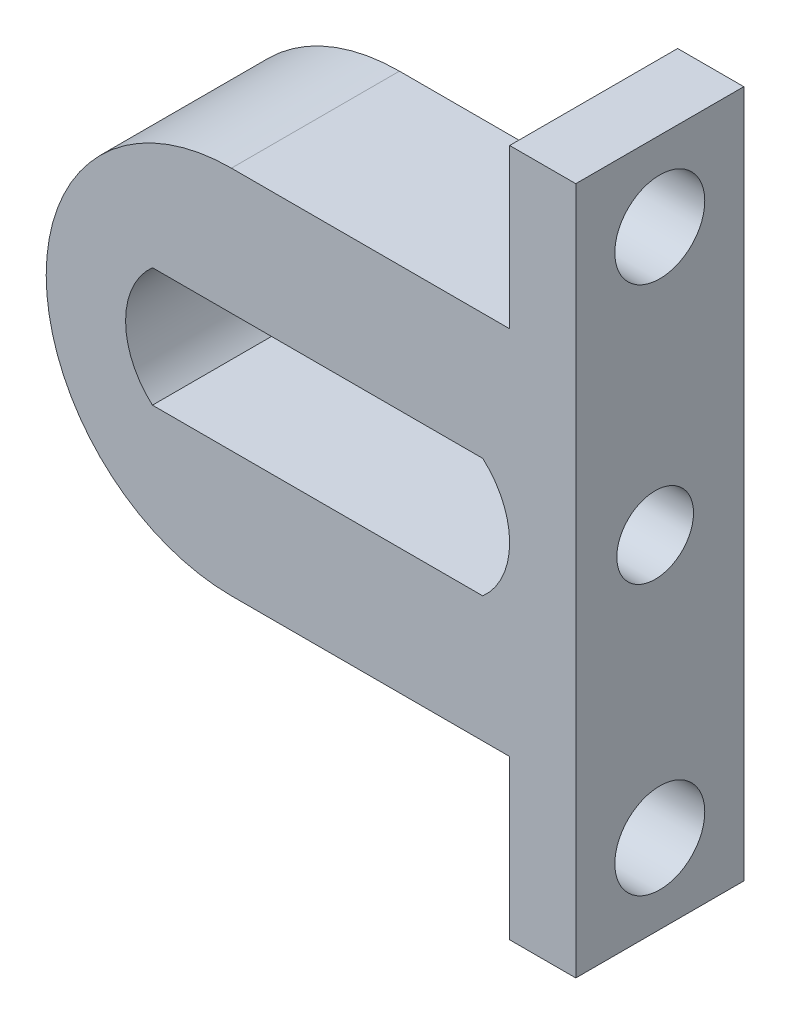
ISO-10303-21;
HEADER;
FILE_DESCRIPTION(('STEP AP214'),'2;1');
FILE_NAME('part.step','',(''),(''),'','','');
FILE_SCHEMA(('AUTOMOTIVE_DESIGN { 1 0 10303 214 1 1 1 1 }'));
ENDSEC;
DATA;
#1=APPLICATION_CONTEXT('core data for automotive mechanical design processes');
#2=APPLICATION_PROTOCOL_DEFINITION('international standard','automotive_design',2000,#1);
#3=PRODUCT_CONTEXT('',#1,'mechanical');
#4=PRODUCT('Part','Part','',(#3));
#5=PRODUCT_RELATED_PRODUCT_CATEGORY('part','',(#4));
#6=PRODUCT_DEFINITION_FORMATION('','',#4);
#7=PRODUCT_DEFINITION_CONTEXT('part definition',#1,'design');
#8=PRODUCT_DEFINITION('design','',#6,#7);
#9=PRODUCT_DEFINITION_SHAPE('','',#8);
#10=(LENGTH_UNIT() NAMED_UNIT(*) SI_UNIT(.MILLI.,.METRE.));
#11=(NAMED_UNIT(*) PLANE_ANGLE_UNIT() SI_UNIT($,.RADIAN.));
#12=(NAMED_UNIT(*) SI_UNIT($,.STERADIAN.) SOLID_ANGLE_UNIT());
#13=UNCERTAINTY_MEASURE_WITH_UNIT(LENGTH_MEASURE(1.E-05),#10,'distance_accuracy_value','');
#14=(GEOMETRIC_REPRESENTATION_CONTEXT(3) GLOBAL_UNCERTAINTY_ASSIGNED_CONTEXT((#13)) GLOBAL_UNIT_ASSIGNED_CONTEXT((#10,
#11,#12)) REPRESENTATION_CONTEXT('',''));
#15=CARTESIAN_POINT('',(0.,0.,0.));
#16=DIRECTION('',(0.,0.,1.));
#17=DIRECTION('',(1.,0.,0.));
#18=AXIS2_PLACEMENT_3D('',#15,#16,#17);
#19=CARTESIAN_POINT('',(502.194313483298,55.7906330730378,6.35));
#20=DIRECTION('',(0.,0.,1.));
#21=DIRECTION('',(1.,0.,0.));
#22=AXIS2_PLACEMENT_3D('',#19,#20,#21);
#23=PLANE('',#22);
#24=DIRECTION('',(0.,1.,0.));
#25=VECTOR('',#24,1.);
#26=CARTESIAN_POINT('',(515.21,42.7906330730378,6.35));
#27=LINE('',#26,#25);
#28=CARTESIAN_POINT('',(515.21,42.7906330730378,6.35));
#29=VERTEX_POINT('',#28);
#30=CARTESIAN_POINT('',(515.21,68.7906330730378,6.35));
#31=VERTEX_POINT('',#30);
#32=EDGE_CURVE('E158',#29,#31,#27,.T.);
#33=ORIENTED_EDGE('',*,*,#32,.T.);
#34=DIRECTION('',(-1.,0.,0.));
#35=VECTOR('',#34,1.);
#36=CARTESIAN_POINT('',(515.21,68.7906330730378,6.35));
#37=LINE('',#36,#35);
#38=CARTESIAN_POINT('',(512.71,68.7906330730378,6.35));
#39=VERTEX_POINT('',#38);
#40=EDGE_CURVE('E161',#31,#39,#37,.T.);
#41=ORIENTED_EDGE('',*,*,#40,.T.);
#42=DIRECTION('',(0.,-1.,0.));
#43=VECTOR('',#42,1.);
#44=CARTESIAN_POINT('',(512.71,62.7906330730378,6.35));
#45=LINE('',#44,#43);
#46=CARTESIAN_POINT('',(512.71,62.7906330730378,6.35));
#47=VERTEX_POINT('',#46);
#48=EDGE_CURVE('E164',#39,#47,#45,.T.);
#49=ORIENTED_EDGE('',*,*,#48,.T.);
#50=DIRECTION('',(-1.,0.,0.));
#51=VECTOR('',#50,1.);
#52=CARTESIAN_POINT('',(502.194313483298,62.7906330730377,6.35));
#53=LINE('',#52,#51);
#54=CARTESIAN_POINT('',(502.194313483298,62.7906330730377,6.35));
#55=VERTEX_POINT('',#54);
#56=EDGE_CURVE('E166',#47,#55,#53,.T.);
#57=ORIENTED_EDGE('',*,*,#56,.T.);
#58=CARTESIAN_POINT('',(502.194313483298,55.7906330730378,6.35));
#59=DIRECTION('',(0.,0.,1.));
#60=DIRECTION('',(1.,0.,0.));
#61=AXIS2_PLACEMENT_3D('',#58,#59,#60);
#62=CIRCLE('',#61,6.99999999999998);
#63=CARTESIAN_POINT('',(502.194313483298,48.7906330730378,6.35));
#64=VERTEX_POINT('',#63);
#65=EDGE_CURVE('E168',#55,#64,#62,.T.);
#66=ORIENTED_EDGE('',*,*,#65,.T.);
#67=DIRECTION('',(1.,0.,0.));
#68=VECTOR('',#67,1.);
#69=CARTESIAN_POINT('',(512.71,48.7906330730378,6.35));
#70=LINE('',#69,#68);
#71=CARTESIAN_POINT('',(512.71,48.7906330730378,6.35));
#72=VERTEX_POINT('',#71);
#73=EDGE_CURVE('E170',#64,#72,#70,.T.);
#74=ORIENTED_EDGE('',*,*,#73,.T.);
#75=DIRECTION('',(0.,-1.,0.));
#76=VECTOR('',#75,1.);
#77=CARTESIAN_POINT('',(512.71,42.7906330730378,6.35));
#78=LINE('',#77,#76);
#79=CARTESIAN_POINT('',(512.71,42.7906330730378,6.35));
#80=VERTEX_POINT('',#79);
#81=EDGE_CURVE('E172',#72,#80,#78,.T.);
#82=ORIENTED_EDGE('',*,*,#81,.T.);
#83=DIRECTION('',(1.,0.,0.));
#84=VECTOR('',#83,1.);
#85=CARTESIAN_POINT('',(515.21,42.7906330730378,6.35));
#86=LINE('',#85,#84);
#87=EDGE_CURVE('E174',#80,#29,#86,.T.);
#88=ORIENTED_EDGE('',*,*,#87,.T.);
#89=EDGE_LOOP('',(#33,#41,#49,#57,#66,#74,#82,#88));
#90=FACE_BOUND('',#89,.T.);
#91=DIRECTION('',(-1.,0.,0.));
#92=VECTOR('',#91,1.);
#93=CARTESIAN_POINT('',(511.694313483298,58.0406330730378,6.35));
#94=LINE('',#93,#92);
#95=CARTESIAN_POINT('',(511.694313483298,58.0406330730378,6.35));
#96=VERTEX_POINT('',#95);
#97=CARTESIAN_POINT('',(499.21,58.0406330730378,6.35));
#98=VERTEX_POINT('',#97);
#99=EDGE_CURVE('E128',#96,#98,#94,.T.);
#100=ORIENTED_EDGE('',*,*,#99,.F.);
#101=CARTESIAN_POINT('',(509.71,55.7906330730378,6.35));
#102=DIRECTION('',(0.,0.,1.));
#103=DIRECTION('',(1.,0.,0.));
#104=AXIS2_PLACEMENT_3D('',#101,#102,#103);
#105=CIRCLE('',#104,2.99999999999998);
#106=CARTESIAN_POINT('',(511.694313483298,53.5406330730378,6.35));
#107=VERTEX_POINT('',#106);
#108=EDGE_CURVE('E120',#107,#96,#105,.T.);
#109=ORIENTED_EDGE('',*,*,#108,.F.);
#110=DIRECTION('',(1.,0.,0.));
#111=VECTOR('',#110,1.);
#112=CARTESIAN_POINT('',(511.694313483298,53.5406330730378,6.35));
#113=LINE('',#112,#111);
#114=CARTESIAN_POINT('',(499.21,53.5406330730378,6.35));
#115=VERTEX_POINT('',#114);
#116=EDGE_CURVE('E142',#115,#107,#113,.T.);
#117=ORIENTED_EDGE('',*,*,#116,.F.);
#118=CARTESIAN_POINT('',(501.194313483298,55.7906330730378,6.35));
#119=DIRECTION('',(0.,0.,1.));
#120=DIRECTION('',(1.,0.,0.));
#121=AXIS2_PLACEMENT_3D('',#118,#119,#120);
#122=CIRCLE('',#121,2.99999999999998);
#123=EDGE_CURVE('E140',#98,#115,#122,.T.);
#124=ORIENTED_EDGE('',*,*,#123,.F.);
#125=EDGE_LOOP('',(#100,#109,#117,#124));
#126=FACE_BOUND('',#125,.T.);
#127=ADVANCED_FACE('F31',(#90,#126),#23,.T.);
#128=CARTESIAN_POINT('',(502.194313483298,55.7906330730378,0.));
#129=DIRECTION('',(0.,0.,1.));
#130=DIRECTION('',(1.,0.,0.));
#131=AXIS2_PLACEMENT_3D('',#128,#129,#130);
#132=PLANE('',#131);
#133=DIRECTION('',(0.,1.,0.));
#134=VECTOR('',#133,1.);
#135=CARTESIAN_POINT('',(515.21,42.7906330730378,0.));
#136=LINE('',#135,#134);
#137=CARTESIAN_POINT('',(515.21,42.7906330730378,0.));
#138=VERTEX_POINT('',#137);
#139=CARTESIAN_POINT('',(515.21,68.7906330730378,0.));
#140=VERTEX_POINT('',#139);
#141=EDGE_CURVE('E136',#138,#140,#136,.T.);
#142=ORIENTED_EDGE('',*,*,#141,.F.);
#143=DIRECTION('',(1.,0.,0.));
#144=VECTOR('',#143,1.);
#145=CARTESIAN_POINT('',(515.21,42.7906330730378,0.));
#146=LINE('',#145,#144);
#147=CARTESIAN_POINT('',(512.71,42.7906330730378,0.));
#148=VERTEX_POINT('',#147);
#149=EDGE_CURVE('E162',#148,#138,#146,.T.);
#150=ORIENTED_EDGE('',*,*,#149,.F.);
#151=DIRECTION('',(0.,-1.,0.));
#152=VECTOR('',#151,1.);
#153=CARTESIAN_POINT('',(512.71,42.7906330730378,0.));
#154=LINE('',#153,#152);
#155=CARTESIAN_POINT('',(512.71,48.7906330730378,0.));
#156=VERTEX_POINT('',#155);
#157=EDGE_CURVE('E189',#156,#148,#154,.T.);
#158=ORIENTED_EDGE('',*,*,#157,.F.);
#159=DIRECTION('',(1.,0.,0.));
#160=VECTOR('',#159,1.);
#161=CARTESIAN_POINT('',(512.71,48.7906330730378,0.));
#162=LINE('',#161,#160);
#163=CARTESIAN_POINT('',(502.194313483298,48.7906330730378,0.));
#164=VERTEX_POINT('',#163);
#165=EDGE_CURVE('E187',#164,#156,#162,.T.);
#166=ORIENTED_EDGE('',*,*,#165,.F.);
#167=CARTESIAN_POINT('',(502.194313483298,55.7906330730378,0.));
#168=DIRECTION('',(0.,0.,1.));
#169=DIRECTION('',(1.,0.,0.));
#170=AXIS2_PLACEMENT_3D('',#167,#168,#169);
#171=CIRCLE('',#170,6.99999999999998);
#172=CARTESIAN_POINT('',(502.194313483298,62.7906330730377,0.));
#173=VERTEX_POINT('',#172);
#174=EDGE_CURVE('E185',#173,#164,#171,.T.);
#175=ORIENTED_EDGE('',*,*,#174,.F.);
#176=DIRECTION('',(-1.,0.,0.));
#177=VECTOR('',#176,1.);
#178=CARTESIAN_POINT('',(502.194313483298,62.7906330730377,0.));
#179=LINE('',#178,#177);
#180=CARTESIAN_POINT('',(512.71,62.7906330730378,0.));
#181=VERTEX_POINT('',#180);
#182=EDGE_CURVE('E183',#181,#173,#179,.T.);
#183=ORIENTED_EDGE('',*,*,#182,.F.);
#184=DIRECTION('',(0.,-1.,0.));
#185=VECTOR('',#184,1.);
#186=CARTESIAN_POINT('',(512.71,62.7906330730378,0.));
#187=LINE('',#186,#185);
#188=CARTESIAN_POINT('',(512.71,68.7906330730378,0.));
#189=VERTEX_POINT('',#188);
#190=EDGE_CURVE('E181',#189,#181,#187,.T.);
#191=ORIENTED_EDGE('',*,*,#190,.F.);
#192=DIRECTION('',(-1.,0.,0.));
#193=VECTOR('',#192,1.);
#194=CARTESIAN_POINT('',(515.21,68.7906330730378,0.));
#195=LINE('',#194,#193);
#196=EDGE_CURVE('E179',#140,#189,#195,.T.);
#197=ORIENTED_EDGE('',*,*,#196,.F.);
#198=EDGE_LOOP('',(#142,#150,#158,#166,#175,#183,#191,#197));
#199=FACE_BOUND('',#198,.T.);
#200=CARTESIAN_POINT('',(509.71,55.7906330730378,0.));
#201=DIRECTION('',(0.,0.,1.));
#202=DIRECTION('',(1.,0.,0.));
#203=AXIS2_PLACEMENT_3D('',#200,#201,#202);
#204=CIRCLE('',#203,2.99999999999998);
#205=CARTESIAN_POINT('',(511.694313483298,53.5406330730378,0.));
#206=VERTEX_POINT('',#205);
#207=CARTESIAN_POINT('',(511.694313483298,58.0406330730378,0.));
#208=VERTEX_POINT('',#207);
#209=EDGE_CURVE('E54',#206,#208,#204,.T.);
#210=ORIENTED_EDGE('',*,*,#209,.T.);
#211=DIRECTION('',(-1.,0.,0.));
#212=VECTOR('',#211,1.);
#213=CARTESIAN_POINT('',(511.694313483298,58.0406330730378,0.));
#214=LINE('',#213,#212);
#215=CARTESIAN_POINT('',(499.21,58.0406330730378,0.));
#216=VERTEX_POINT('',#215);
#217=EDGE_CURVE('E135',#208,#216,#214,.T.);
#218=ORIENTED_EDGE('',*,*,#217,.T.);
#219=CARTESIAN_POINT('',(501.194313483298,55.7906330730378,0.));
#220=DIRECTION('',(0.,0.,1.));
#221=DIRECTION('',(1.,0.,0.));
#222=AXIS2_PLACEMENT_3D('',#219,#220,#221);
#223=CIRCLE('',#222,2.99999999999998);
#224=CARTESIAN_POINT('',(499.21,53.5406330730378,0.));
#225=VERTEX_POINT('',#224);
#226=EDGE_CURVE('E150',#216,#225,#223,.T.);
#227=ORIENTED_EDGE('',*,*,#226,.T.);
#228=DIRECTION('',(1.,0.,0.));
#229=VECTOR('',#228,1.);
#230=CARTESIAN_POINT('',(511.694313483298,53.5406330730378,0.));
#231=LINE('',#230,#229);
#232=EDGE_CURVE('E129',#225,#206,#231,.T.);
#233=ORIENTED_EDGE('',*,*,#232,.T.);
#234=EDGE_LOOP('',(#210,#218,#227,#233));
#235=FACE_BOUND('',#234,.T.);
#236=ADVANCED_FACE('F219',(#199,#235),#132,.F.);
#237=CARTESIAN_POINT('',(515.21,42.7906330730378,6.35));
#238=DIRECTION('',(-1.,0.,0.));
#239=DIRECTION('',(0.,0.,1.));
#240=AXIS2_PLACEMENT_3D('',#237,#238,#239);
#241=PLANE('',#240);
#242=CARTESIAN_POINT('',(515.21,65.7906330730378,3.175));
#243=DIRECTION('',(1.,0.,0.));
#244=DIRECTION('',(0.,0.,-1.));
#245=AXIS2_PLACEMENT_3D('',#242,#243,#244);
#246=CIRCLE('',#245,1.7);
#247=CARTESIAN_POINT('',(515.21,65.7906330730378,1.475));
#248=VERTEX_POINT('',#247);
#249=EDGE_CURVE('E288',#248,#248,#246,.T.);
#250=ORIENTED_EDGE('',*,*,#249,.F.);
#251=EDGE_LOOP('',(#250));
#252=FACE_BOUND('',#251,.T.);
#253=CARTESIAN_POINT('',(515.21,55.7906330730378,3.35));
#254=DIRECTION('',(1.,0.,0.));
#255=DIRECTION('',(0.,0.,-1.));
#256=AXIS2_PLACEMENT_3D('',#253,#254,#255);
#257=CIRCLE('',#256,1.45);
#258=CARTESIAN_POINT('',(515.21,55.7906330730378,1.9));
#259=VERTEX_POINT('',#258);
#260=EDGE_CURVE('E281',#259,#259,#257,.T.);
#261=ORIENTED_EDGE('',*,*,#260,.F.);
#262=EDGE_LOOP('',(#261));
#263=FACE_BOUND('',#262,.T.);
#264=CARTESIAN_POINT('',(515.21,45.7906330730378,3.175));
#265=DIRECTION('',(1.,0.,0.));
#266=DIRECTION('',(0.,0.,-1.));
#267=AXIS2_PLACEMENT_3D('',#264,#265,#266);
#268=CIRCLE('',#267,1.7);
#269=CARTESIAN_POINT('',(515.21,45.7906330730378,1.475));
#270=VERTEX_POINT('',#269);
#271=EDGE_CURVE('E285',#270,#270,#268,.T.);
#272=ORIENTED_EDGE('',*,*,#271,.F.);
#273=EDGE_LOOP('',(#272));
#274=FACE_BOUND('',#273,.T.);
#275=ORIENTED_EDGE('',*,*,#141,.T.);
#276=DIRECTION('',(0.,0.,-1.));
#277=VECTOR('',#276,1.);
#278=CARTESIAN_POINT('',(515.21,68.7906330730378,6.35));
#279=LINE('',#278,#277);
#280=EDGE_CURVE('E11',#31,#140,#279,.T.);
#281=ORIENTED_EDGE('',*,*,#280,.F.);
#282=ORIENTED_EDGE('',*,*,#32,.F.);
#283=DIRECTION('',(0.,0.,-1.));
#284=VECTOR('',#283,1.);
#285=CARTESIAN_POINT('',(515.21,42.7906330730378,6.35));
#286=LINE('',#285,#284);
#287=EDGE_CURVE('E176',#29,#138,#286,.T.);
#288=ORIENTED_EDGE('',*,*,#287,.T.);
#289=EDGE_LOOP('',(#275,#281,#282,#288));
#290=FACE_BOUND('',#289,.T.);
#291=ADVANCED_FACE('F33',(#252,#263,#274,#290),#241,.F.);
#292=CARTESIAN_POINT('',(515.21,68.7906330730378,6.35));
#293=DIRECTION('',(0.,-1.,0.));
#294=DIRECTION('',(0.,0.,-1.));
#295=AXIS2_PLACEMENT_3D('',#292,#293,#294);
#296=PLANE('',#295);
#297=ORIENTED_EDGE('',*,*,#196,.T.);
#298=DIRECTION('',(0.,0.,-1.));
#299=VECTOR('',#298,1.);
#300=CARTESIAN_POINT('',(512.71,68.7906330730378,6.35));
#301=LINE('',#300,#299);
#302=EDGE_CURVE('E39',#39,#189,#301,.T.);
#303=ORIENTED_EDGE('',*,*,#302,.F.);
#304=ORIENTED_EDGE('',*,*,#40,.F.);
#305=ORIENTED_EDGE('',*,*,#280,.T.);
#306=EDGE_LOOP('',(#297,#303,#304,#305));
#307=FACE_BOUND('',#306,.T.);
#308=ADVANCED_FACE('F236',(#307),#296,.F.);
#309=CARTESIAN_POINT('',(512.71,62.7906330730378,6.35));
#310=DIRECTION('',(1.,0.,0.));
#311=DIRECTION('',(0.,0.,-1.));
#312=AXIS2_PLACEMENT_3D('',#309,#310,#311);
#313=PLANE('',#312);
#314=CARTESIAN_POINT('',(512.71,65.7906330730378,3.175));
#315=DIRECTION('',(1.,0.,0.));
#316=DIRECTION('',(0.,0.,-1.));
#317=AXIS2_PLACEMENT_3D('',#314,#315,#316);
#318=CIRCLE('',#317,1.7);
#319=CARTESIAN_POINT('',(512.71,65.7906330730378,1.475));
#320=VERTEX_POINT('',#319);
#321=EDGE_CURVE('E282',#320,#320,#318,.F.);
#322=ORIENTED_EDGE('',*,*,#321,.F.);
#323=EDGE_LOOP('',(#322));
#324=FACE_BOUND('',#323,.T.);
#325=ORIENTED_EDGE('',*,*,#190,.T.);
#326=DIRECTION('',(0.,0.,-1.));
#327=VECTOR('',#326,1.);
#328=CARTESIAN_POINT('',(512.71,62.7906330730378,6.35));
#329=LINE('',#328,#327);
#330=EDGE_CURVE('E206',#47,#181,#329,.T.);
#331=ORIENTED_EDGE('',*,*,#330,.F.);
#332=ORIENTED_EDGE('',*,*,#48,.F.);
#333=ORIENTED_EDGE('',*,*,#302,.T.);
#334=EDGE_LOOP('',(#325,#331,#332,#333));
#335=FACE_BOUND('',#334,.T.);
#336=ADVANCED_FACE('F213',(#324,#335),#313,.F.);
#337=CARTESIAN_POINT('',(502.194313483298,62.7906330730377,6.35));
#338=DIRECTION('',(0.,-1.,0.));
#339=DIRECTION('',(1.,0.,0.));
#340=AXIS2_PLACEMENT_3D('',#337,#338,#339);
#341=PLANE('',#340);
#342=ORIENTED_EDGE('',*,*,#182,.T.);
#343=DIRECTION('',(0.,0.,-1.));
#344=VECTOR('',#343,1.);
#345=CARTESIAN_POINT('',(502.194313483298,62.7906330730377,6.35));
#346=LINE('',#345,#344);
#347=EDGE_CURVE('E203',#55,#173,#346,.T.);
#348=ORIENTED_EDGE('',*,*,#347,.F.);
#349=ORIENTED_EDGE('',*,*,#56,.F.);
#350=ORIENTED_EDGE('',*,*,#330,.T.);
#351=EDGE_LOOP('',(#342,#348,#349,#350));
#352=FACE_BOUND('',#351,.T.);
#353=ADVANCED_FACE('F225',(#352),#341,.F.);
#354=CARTESIAN_POINT('',(502.194313483298,55.7906330730378,6.35));
#355=DIRECTION('',(0.,0.,-1.));
#356=DIRECTION('',(-1.,0.,0.));
#357=AXIS2_PLACEMENT_3D('',#354,#355,#356);
#358=CYLINDRICAL_SURFACE('',#357,6.99999999999998);
#359=ORIENTED_EDGE('',*,*,#174,.T.);
#360=DIRECTION('',(0.,0.,-1.));
#361=VECTOR('',#360,1.);
#362=CARTESIAN_POINT('',(502.194313483298,48.7906330730378,6.35));
#363=LINE('',#362,#361);
#364=EDGE_CURVE('E200',#64,#164,#363,.T.);
#365=ORIENTED_EDGE('',*,*,#364,.F.);
#366=ORIENTED_EDGE('',*,*,#65,.F.);
#367=ORIENTED_EDGE('',*,*,#347,.T.);
#368=EDGE_LOOP('',(#359,#365,#366,#367));
#369=FACE_BOUND('',#368,.T.);
#370=ADVANCED_FACE('F229',(#369),#358,.T.);
#371=CARTESIAN_POINT('',(512.71,48.7906330730378,6.35));
#372=DIRECTION('',(0.,1.,0.));
#373=DIRECTION('',(-1.,0.,0.));
#374=AXIS2_PLACEMENT_3D('',#371,#372,#373);
#375=PLANE('',#374);
#376=ORIENTED_EDGE('',*,*,#165,.T.);
#377=DIRECTION('',(0.,0.,-1.));
#378=VECTOR('',#377,1.);
#379=CARTESIAN_POINT('',(512.71,48.7906330730378,6.35));
#380=LINE('',#379,#378);
#381=EDGE_CURVE('E197',#72,#156,#380,.T.);
#382=ORIENTED_EDGE('',*,*,#381,.F.);
#383=ORIENTED_EDGE('',*,*,#73,.F.);
#384=ORIENTED_EDGE('',*,*,#364,.T.);
#385=EDGE_LOOP('',(#376,#382,#383,#384));
#386=FACE_BOUND('',#385,.T.);
#387=ADVANCED_FACE('F249',(#386),#375,.F.);
#388=CARTESIAN_POINT('',(512.71,42.7906330730378,6.35));
#389=DIRECTION('',(1.,0.,0.));
#390=DIRECTION('',(0.,0.,-1.));
#391=AXIS2_PLACEMENT_3D('',#388,#389,#390);
#392=PLANE('',#391);
#393=CARTESIAN_POINT('',(512.71,45.7906330730378,3.175));
#394=DIRECTION('',(1.,0.,0.));
#395=DIRECTION('',(0.,0.,-1.));
#396=AXIS2_PLACEMENT_3D('',#393,#394,#395);
#397=CIRCLE('',#396,1.7);
#398=CARTESIAN_POINT('',(512.71,45.7906330730378,1.475));
#399=VERTEX_POINT('',#398);
#400=EDGE_CURVE('E148',#399,#399,#397,.F.);
#401=ORIENTED_EDGE('',*,*,#400,.F.);
#402=EDGE_LOOP('',(#401));
#403=FACE_BOUND('',#402,.T.);
#404=ORIENTED_EDGE('',*,*,#157,.T.);
#405=DIRECTION('',(0.,0.,-1.));
#406=VECTOR('',#405,1.);
#407=CARTESIAN_POINT('',(512.71,42.7906330730378,6.35));
#408=LINE('',#407,#406);
#409=EDGE_CURVE('E194',#80,#148,#408,.T.);
#410=ORIENTED_EDGE('',*,*,#409,.F.);
#411=ORIENTED_EDGE('',*,*,#81,.F.);
#412=ORIENTED_EDGE('',*,*,#381,.T.);
#413=EDGE_LOOP('',(#404,#410,#411,#412));
#414=FACE_BOUND('',#413,.T.);
#415=ADVANCED_FACE('F247',(#403,#414),#392,.F.);
#416=CARTESIAN_POINT('',(515.21,42.7906330730378,6.35));
#417=DIRECTION('',(0.,1.,0.));
#418=DIRECTION('',(0.,0.,1.));
#419=AXIS2_PLACEMENT_3D('',#416,#417,#418);
#420=PLANE('',#419);
#421=ORIENTED_EDGE('',*,*,#149,.T.);
#422=ORIENTED_EDGE('',*,*,#287,.F.);
#423=ORIENTED_EDGE('',*,*,#87,.F.);
#424=ORIENTED_EDGE('',*,*,#409,.T.);
#425=EDGE_LOOP('',(#421,#422,#423,#424));
#426=FACE_BOUND('',#425,.T.);
#427=ADVANCED_FACE('F242',(#426),#420,.F.);
#428=CARTESIAN_POINT('',(509.71,55.7906330730378,6.35));
#429=DIRECTION('',(0.,0.,-1.));
#430=DIRECTION('',(-1.,0.,0.));
#431=AXIS2_PLACEMENT_3D('',#428,#429,#430);
#432=CYLINDRICAL_SURFACE('',#431,2.99999999999998);
#433=CARTESIAN_POINT('',(512.71,55.7906330730378,1.9));
#434=CARTESIAN_POINT('',(512.709996120813,55.8671638005357,1.90000454051934));
#435=CARTESIAN_POINT('',(512.70703967394,55.9437947157731,1.90609458799086));
#436=CARTESIAN_POINT('',(512.695505011524,56.0948106776822,1.93019437682024));
#437=CARTESIAN_POINT('',(512.686915203961,56.1691907618394,1.94822869720593));
#438=CARTESIAN_POINT('',(512.665016903127,56.3132865396194,1.99535722985119));
#439=CARTESIAN_POINT('',(512.65172634015,56.3830187769333,2.02440944608167));
#440=CARTESIAN_POINT('',(512.621661023413,56.5165251739773,2.09254126521249));
#441=CARTESIAN_POINT('',(512.604886697689,56.5803000642682,2.13161963637864));
#442=CARTESIAN_POINT('',(512.568281852369,56.7042173181824,2.22126434495922));
#443=CARTESIAN_POINT('',(512.548330923377,56.7639386061572,2.27236289708863));
#444=CARTESIAN_POINT('',(512.508039454466,56.8743469791893,2.38345730788836));
#445=CARTESIAN_POINT('',(512.48769864962,56.9250276612452,2.44345941783253));
#446=CARTESIAN_POINT('',(512.447270737028,57.0195254744831,2.5757950833783));
#447=CARTESIAN_POINT('',(512.427304864761,57.0625967489676,2.64870252781686));
#448=CARTESIAN_POINT('',(512.391883383016,57.1356841562065,2.80180406813567));
#449=CARTESIAN_POINT('',(512.376424719151,57.1657091368037,2.88199318091417));
#450=CARTESIAN_POINT('',(512.353115220385,57.2099776738166,3.04261116524232));
#451=CARTESIAN_POINT('',(512.344875171374,57.2250354704915,3.12275643535873));
#452=CARTESIAN_POINT('',(512.335876537716,57.2414501537766,3.2848250536738));
#453=CARTESIAN_POINT('',(512.335111392162,57.2428190554925,3.36674677931406));
#454=CARTESIAN_POINT('',(512.340832064055,57.2324170367151,3.52037720233886));
#455=CARTESIAN_POINT('',(512.346530152182,57.2220738120741,3.59221876115115));
#456=CARTESIAN_POINT('',(512.363165204595,57.1909979495867,3.73298277173976));
#457=CARTESIAN_POINT('',(512.374103664513,57.1702623456197,3.80190438403107));
#458=CARTESIAN_POINT('',(512.400235710196,57.1185949824647,3.93682221606916));
#459=CARTESIAN_POINT('',(512.41552247128,57.0874369857492,4.00271290766918));
#460=CARTESIAN_POINT('',(512.448626866195,57.0159786383798,4.12863681021759));
#461=CARTESIAN_POINT('',(512.466445625097,56.9756742188129,4.18866739716707));
#462=CARTESIAN_POINT('',(512.505139328159,56.8815390448591,4.30859047880133));
#463=CARTESIAN_POINT('',(512.526127412756,56.8266755745306,4.36763856656668));
#464=CARTESIAN_POINT('',(512.56708426032,56.7077084161121,4.47603367679154));
#465=CARTESIAN_POINT('',(512.587052593144,56.6436008716497,4.52537663012665));
#466=CARTESIAN_POINT('',(512.624718855516,56.5046340370301,4.61483223781985));
#467=CARTESIAN_POINT('',(512.642291076559,56.4294430240008,4.65448671536064));
#468=CARTESIAN_POINT('',(512.67214084082,56.2723910141114,4.72027077256354));
#469=CARTESIAN_POINT('',(512.684422323993,56.1905350347815,4.74641041948709));
#470=CARTESIAN_POINT('',(512.701490745182,56.0294212675513,4.78239158215606));
#471=CARTESIAN_POINT('',(512.70679351596,55.9504698537253,4.79335841629938));
#472=CARTESIAN_POINT('',(512.711049123702,55.7916803451623,4.80217544252438));
#473=CARTESIAN_POINT('',(512.71000468355,55.7118426453024,4.80003125908766));
#474=CARTESIAN_POINT('',(512.701992813503,55.5595913738422,4.78337558743059));
#475=CARTESIAN_POINT('',(512.695453252822,55.4870544955086,4.7697573111068));
#476=CARTESIAN_POINT('',(512.677640242866,55.3454274142302,4.73190686718402));
#477=CARTESIAN_POINT('',(512.666366255771,55.276337603862,4.70767349372184));
#478=CARTESIAN_POINT('',(512.639696471727,55.1411975181961,4.64858985122823));
#479=CARTESIAN_POINT('',(512.624187821198,55.0752992490074,4.61344462479574));
#480=CARTESIAN_POINT('',(512.590577420374,54.9501083556124,4.53386087389152));
#481=CARTESIAN_POINT('',(512.572474541511,54.8908186263857,4.48941830089837));
#482=CARTESIAN_POINT('',(512.533462677922,54.7746846144432,4.38771273329989));
#483=CARTESIAN_POINT('',(512.512449350254,54.7185818271074,4.32964139393037));
#484=CARTESIAN_POINT('',(512.471285276756,54.6166084032236,4.20479121190171));
#485=CARTESIAN_POINT('',(512.451135037319,54.5707437088897,4.13800734791283));
#486=CARTESIAN_POINT('',(512.413238440915,54.4888561302808,3.99419696186196));
#487=CARTESIAN_POINT('',(512.395620661561,54.4533009139544,3.91686736586735));
#488=CARTESIAN_POINT('',(512.366367720056,54.3960867412208,3.75618965009693));
#489=CARTESIAN_POINT('',(512.35472537944,54.3744111030878,3.672848889697));
#490=CARTESIAN_POINT('',(512.340113247011,54.3474705885969,3.51087109965609));
#491=CARTESIAN_POINT('',(512.336434575035,54.3408612239162,3.43252248368154));
#492=CARTESIAN_POINT('',(512.336190396806,54.3404168354502,3.275790225));
#493=CARTESIAN_POINT('',(512.339622415745,54.3465773672224,3.19740660396904));
#494=CARTESIAN_POINT('',(512.352480355355,54.3702628410193,3.04970843588792));
#495=CARTESIAN_POINT('',(512.361381278269,54.3867948111026,2.9801834859031));
#496=CARTESIAN_POINT('',(512.383597194996,54.4295835872121,2.84494752723667));
#497=CARTESIAN_POINT('',(512.396913546391,54.4558433844792,2.77923769887561));
#498=CARTESIAN_POINT('',(512.427555921327,54.5193309833468,2.64863489093796));
#499=CARTESIAN_POINT('',(512.445091047269,54.5571765360594,2.58409261384695));
#500=CARTESIAN_POINT('',(512.481800937264,54.6420441298391,2.46186405678044));
#501=CARTESIAN_POINT('',(512.500976513897,54.6890707336121,2.40418120876461));
#502=CARTESIAN_POINT('',(512.541348507621,54.7970828039165,2.29068285436661));
#503=CARTESIAN_POINT('',(512.562533725527,54.8590371007478,2.23578040555072));
#504=CARTESIAN_POINT('',(512.602555235273,54.9919247840983,2.13697934885735));
#505=CARTESIAN_POINT('',(512.621390345915,55.0628626500815,2.09308626333246));
#506=CARTESIAN_POINT('',(512.654678651136,55.2120896356891,2.01779340357102));
#507=CARTESIAN_POINT('',(512.669130475603,55.2903810438632,1.98639753471407));
#508=CARTESIAN_POINT('',(512.691925395612,55.451924198062,1.93760808408236));
#509=CARTESIAN_POINT('',(512.700286278153,55.5351607269358,1.92017371648439));
#510=CARTESIAN_POINT('',(512.706731744922,55.6477395442924,1.90677263876362));
#511=CARTESIAN_POINT('',(512.707954546114,55.6762406056135,1.9042360394183));
#512=CARTESIAN_POINT('',(512.709589409727,55.7333674566045,1.90084884917815));
#513=CARTESIAN_POINT('',(512.710001451694,55.7619932494027,1.8999983008175));
#514=CARTESIAN_POINT('',(512.71,55.7906330730378,1.9));
#515=B_SPLINE_CURVE_WITH_KNOTS('',3,(#433,#434,#435,#436,#437,#438,#439,#440,#441,#442,#443,
#444,#445,#446,#447,#448,#449,#450,#451,#452,#453,#454,#455,#456,#457,#458,#459,#460,#461,#462,
#463,#464,#465,#466,#467,#468,#469,#470,#471,#472,#473,#474,#475,#476,#477,#478,#479,#480,#481,
#482,#483,#484,#485,#486,#487,#488,#489,#490,#491,#492,#493,#494,#495,#496,#497,#498,#499,#500,
#501,#502,#503,#504,#505,#506,#507,#508,#509,#510,#511,#512,#513,#514),.UNSPECIFIED.,.T.,.F.,(4,
2,2,2,2,2,2,2,2,2,2,2,2,2,2,2,2,2,2,2,2,2,2,2,2,2,2,2,2,2,2,2,2,2,2,2,2,2,2,2,4),(0.,
0.229475570863171,0.459424831854173,0.688506282141707,0.917559602756527,1.15981165812002,
1.40223461290407,1.66192237223258,1.921433738451,2.16589509779606,2.4101418680794,
2.62754281740568,2.84500585116379,3.06753398921647,3.29016131673733,3.5389377232228,
3.7878182142308,4.04684255861718,4.30567367553667,4.5440379109785,4.78229989797436,
5.00356397823137,5.22485320036186,5.45273911197756,5.6807244636409,5.92993396764367,
6.17928773952594,6.43862695604374,6.69765388739103,6.93247068885981,7.16720577826905,
7.38231982597293,7.59750007476882,7.82711979689812,8.05685392494067,8.31201128566552,
8.56729637980939,8.82266118802038,9.07727724783843,9.16315091326926,9.24902674501594),.UNSPECIFIED.);
#516=CARTESIAN_POINT('',(512.71,55.7906330730378,1.9));
#517=VERTEX_POINT('',#516);
#518=EDGE_CURVE('E279',#517,#517,#515,.T.);
#519=ORIENTED_EDGE('',*,*,#518,.T.);
#520=EDGE_LOOP('',(#519));
#521=FACE_BOUND('',#520,.T.);
#522=ORIENTED_EDGE('',*,*,#209,.F.);
#523=DIRECTION('',(0.,0.,-1.));
#524=VECTOR('',#523,1.);
#525=CARTESIAN_POINT('',(511.694313483298,53.5406330730378,6.35));
#526=LINE('',#525,#524);
#527=EDGE_CURVE('E124',#107,#206,#526,.T.);
#528=ORIENTED_EDGE('',*,*,#527,.F.);
#529=ORIENTED_EDGE('',*,*,#108,.T.);
#530=DIRECTION('',(0.,0.,-1.));
#531=VECTOR('',#530,1.);
#532=CARTESIAN_POINT('',(511.694313483298,58.0406330730378,6.35));
#533=LINE('',#532,#531);
#534=EDGE_CURVE('E123',#96,#208,#533,.T.);
#535=ORIENTED_EDGE('',*,*,#534,.T.);
#536=EDGE_LOOP('',(#522,#528,#529,#535));
#537=FACE_BOUND('',#536,.T.);
#538=ADVANCED_FACE('F122',(#521,#537),#432,.F.);
#539=CARTESIAN_POINT('',(511.694313483298,58.0406330730378,6.35));
#540=DIRECTION('',(0.,-1.,0.));
#541=DIRECTION('',(1.,0.,0.));
#542=AXIS2_PLACEMENT_3D('',#539,#540,#541);
#543=PLANE('',#542);
#544=ORIENTED_EDGE('',*,*,#217,.F.);
#545=ORIENTED_EDGE('',*,*,#534,.F.);
#546=ORIENTED_EDGE('',*,*,#99,.T.);
#547=DIRECTION('',(0.,0.,-1.));
#548=VECTOR('',#547,1.);
#549=CARTESIAN_POINT('',(499.21,58.0406330730378,6.35));
#550=LINE('',#549,#548);
#551=EDGE_CURVE('E137',#98,#216,#550,.T.);
#552=ORIENTED_EDGE('',*,*,#551,.T.);
#553=EDGE_LOOP('',(#544,#545,#546,#552));
#554=FACE_BOUND('',#553,.T.);
#555=ADVANCED_FACE('F132',(#554),#543,.T.);
#556=CARTESIAN_POINT('',(501.194313483298,55.7906330730378,6.35));
#557=DIRECTION('',(0.,0.,-1.));
#558=DIRECTION('',(-1.,0.,0.));
#559=AXIS2_PLACEMENT_3D('',#556,#557,#558);
#560=CYLINDRICAL_SURFACE('',#559,2.99999999999998);
#561=ORIENTED_EDGE('',*,*,#226,.F.);
#562=ORIENTED_EDGE('',*,*,#551,.F.);
#563=ORIENTED_EDGE('',*,*,#123,.T.);
#564=DIRECTION('',(0.,0.,-1.));
#565=VECTOR('',#564,1.);
#566=CARTESIAN_POINT('',(499.21,53.5406330730378,6.35));
#567=LINE('',#566,#565);
#568=EDGE_CURVE('E46',#115,#225,#567,.T.);
#569=ORIENTED_EDGE('',*,*,#568,.T.);
#570=EDGE_LOOP('',(#561,#562,#563,#569));
#571=FACE_BOUND('',#570,.T.);
#572=ADVANCED_FACE('F276',(#571),#560,.F.);
#573=CARTESIAN_POINT('',(511.694313483298,53.5406330730378,6.35));
#574=DIRECTION('',(0.,1.,0.));
#575=DIRECTION('',(-1.,0.,0.));
#576=AXIS2_PLACEMENT_3D('',#573,#574,#575);
#577=PLANE('',#576);
#578=ORIENTED_EDGE('',*,*,#232,.F.);
#579=ORIENTED_EDGE('',*,*,#568,.F.);
#580=ORIENTED_EDGE('',*,*,#116,.T.);
#581=ORIENTED_EDGE('',*,*,#527,.T.);
#582=EDGE_LOOP('',(#578,#579,#580,#581));
#583=FACE_BOUND('',#582,.T.);
#584=ADVANCED_FACE('F336',(#583),#577,.T.);
#585=CARTESIAN_POINT('',(495.193313483298,45.7906330730378,3.175));
#586=DIRECTION('',(1.,0.,0.));
#587=DIRECTION('',(0.,0.,-1.));
#588=AXIS2_PLACEMENT_3D('',#585,#586,#587);
#589=CYLINDRICAL_SURFACE('',#588,1.7);
#590=ORIENTED_EDGE('',*,*,#271,.T.);
#591=EDGE_LOOP('',(#590));
#592=FACE_BOUND('',#591,.T.);
#593=ORIENTED_EDGE('',*,*,#400,.T.);
#594=EDGE_LOOP('',(#593));
#595=FACE_BOUND('',#594,.T.);
#596=ADVANCED_FACE('F307',(#592,#595),#589,.F.);
#597=CARTESIAN_POINT('',(495.193313483298,55.7906330730378,3.35));
#598=DIRECTION('',(1.,0.,0.));
#599=DIRECTION('',(0.,0.,-1.));
#600=AXIS2_PLACEMENT_3D('',#597,#598,#599);
#601=CYLINDRICAL_SURFACE('',#600,1.45);
#602=ORIENTED_EDGE('',*,*,#518,.F.);
#603=EDGE_LOOP('',(#602));
#604=FACE_BOUND('',#603,.T.);
#605=ORIENTED_EDGE('',*,*,#260,.T.);
#606=EDGE_LOOP('',(#605));
#607=FACE_BOUND('',#606,.T.);
#608=ADVANCED_FACE('F296',(#604,#607),#601,.F.);
#609=CARTESIAN_POINT('',(495.193313483298,65.7906330730378,3.175));
#610=DIRECTION('',(1.,0.,0.));
#611=DIRECTION('',(0.,0.,-1.));
#612=AXIS2_PLACEMENT_3D('',#609,#610,#611);
#613=CYLINDRICAL_SURFACE('',#612,1.7);
#614=ORIENTED_EDGE('',*,*,#249,.T.);
#615=EDGE_LOOP('',(#614));
#616=FACE_BOUND('',#615,.T.);
#617=ORIENTED_EDGE('',*,*,#321,.T.);
#618=EDGE_LOOP('',(#617));
#619=FACE_BOUND('',#618,.T.);
#620=ADVANCED_FACE('F301',(#616,#619),#613,.F.);
#621=CLOSED_SHELL('',(#127,#236,#291,#308,#336,#353,#370,#387,#415,#427,#538,#555,#572,#584,
#596,#608,#620));
#622=MANIFOLD_SOLID_BREP('B2',#621);
#623=ADVANCED_BREP_SHAPE_REPRESENTATION('',(#18,#622),#14);
#624=SHAPE_DEFINITION_REPRESENTATION(#9,#623);
ENDSEC;
END-ISO-10303-21;
